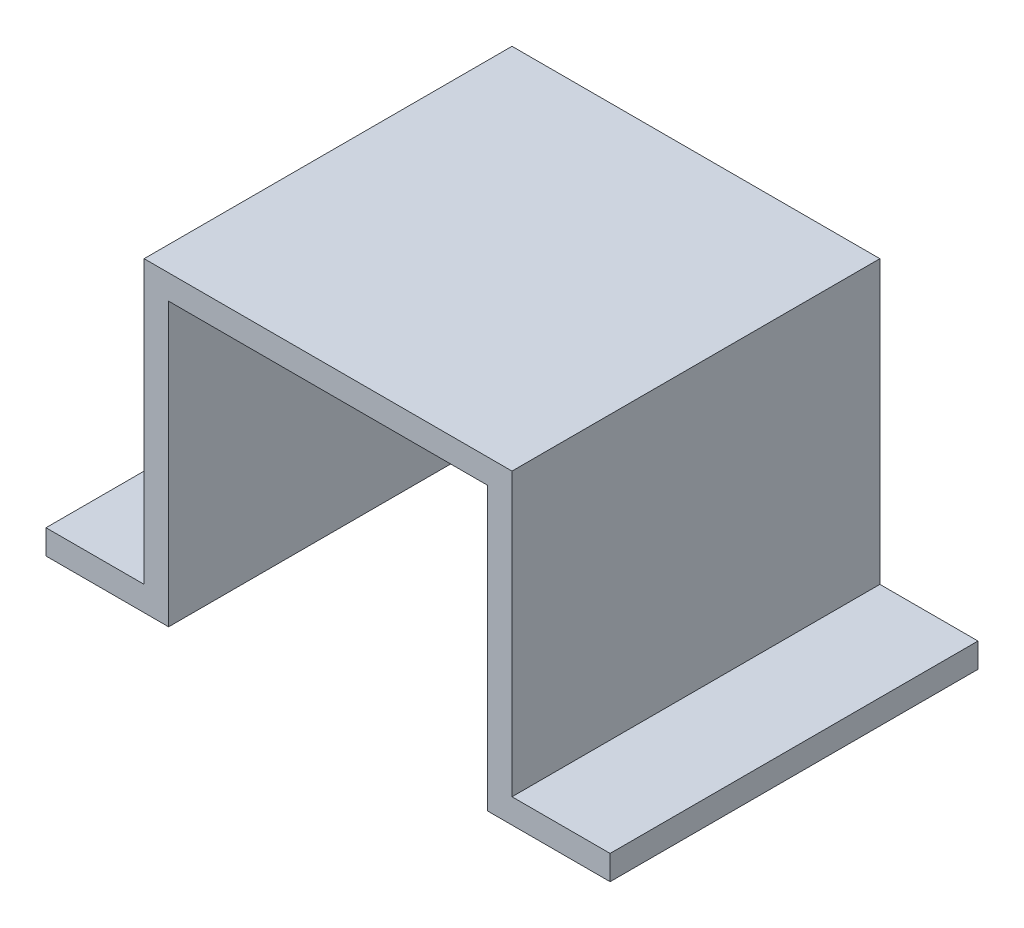
ISO-10303-21;
HEADER;
FILE_DESCRIPTION(('STEP AP214'),'2;1');
FILE_NAME('part.step','',(''),(''),'','','');
FILE_SCHEMA(('AUTOMOTIVE_DESIGN { 1 0 10303 214 1 1 1 1 }'));
ENDSEC;
DATA;
#1=APPLICATION_CONTEXT('core data for automotive mechanical design processes');
#2=APPLICATION_PROTOCOL_DEFINITION('international standard','automotive_design',2000,#1);
#3=PRODUCT_CONTEXT('',#1,'mechanical');
#4=PRODUCT('Part','Part','',(#3));
#5=PRODUCT_RELATED_PRODUCT_CATEGORY('part','',(#4));
#6=PRODUCT_DEFINITION_FORMATION('','',#4);
#7=PRODUCT_DEFINITION_CONTEXT('part definition',#1,'design');
#8=PRODUCT_DEFINITION('design','',#6,#7);
#9=PRODUCT_DEFINITION_SHAPE('','',#8);
#10=(LENGTH_UNIT() NAMED_UNIT(*) SI_UNIT(.MILLI.,.METRE.));
#11=(NAMED_UNIT(*) PLANE_ANGLE_UNIT() SI_UNIT($,.RADIAN.));
#12=(NAMED_UNIT(*) SI_UNIT($,.STERADIAN.) SOLID_ANGLE_UNIT());
#13=UNCERTAINTY_MEASURE_WITH_UNIT(LENGTH_MEASURE(1.E-05),#10,'distance_accuracy_value','');
#14=(GEOMETRIC_REPRESENTATION_CONTEXT(3) GLOBAL_UNCERTAINTY_ASSIGNED_CONTEXT((#13)) GLOBAL_UNIT_ASSIGNED_CONTEXT((#10,
#11,#12)) REPRESENTATION_CONTEXT('',''));
#15=CARTESIAN_POINT('',(0.,0.,0.));
#16=DIRECTION('',(0.,0.,1.));
#17=DIRECTION('',(1.,0.,0.));
#18=AXIS2_PLACEMENT_3D('',#15,#16,#17);
#19=CARTESIAN_POINT('',(0.,0.,-15.));
#20=DIRECTION('',(-1.,0.,0.));
#21=DIRECTION('',(0.,0.,1.));
#22=AXIS2_PLACEMENT_3D('',#19,#20,#21);
#23=PLANE('',#22);
#24=DIRECTION('',(0.,-1.,0.));
#25=VECTOR('',#24,1.);
#26=CARTESIAN_POINT('',(0.,0.,15.));
#27=LINE('',#26,#25);
#28=CARTESIAN_POINT('',(0.,2.,15.));
#29=VERTEX_POINT('',#28);
#30=CARTESIAN_POINT('',(0.,0.,15.));
#31=VERTEX_POINT('',#30);
#32=EDGE_CURVE('E156',#29,#31,#27,.T.);
#33=ORIENTED_EDGE('',*,*,#32,.F.);
#34=DIRECTION('',(0.,0.,1.));
#35=VECTOR('',#34,1.);
#36=CARTESIAN_POINT('',(0.,2.,-15.));
#37=LINE('',#36,#35);
#38=CARTESIAN_POINT('',(0.,2.,-15.));
#39=VERTEX_POINT('',#38);
#40=EDGE_CURVE('E11',#39,#29,#37,.T.);
#41=ORIENTED_EDGE('',*,*,#40,.F.);
#42=DIRECTION('',(0.,-1.,0.));
#43=VECTOR('',#42,1.);
#44=CARTESIAN_POINT('',(0.,0.,-15.));
#45=LINE('',#44,#43);
#46=CARTESIAN_POINT('',(0.,0.,-15.));
#47=VERTEX_POINT('',#46);
#48=EDGE_CURVE('E188',#39,#47,#45,.T.);
#49=ORIENTED_EDGE('',*,*,#48,.T.);
#50=DIRECTION('',(0.,0.,1.));
#51=VECTOR('',#50,1.);
#52=CARTESIAN_POINT('',(0.,0.,-15.));
#53=LINE('',#52,#51);
#54=EDGE_CURVE('E38',#47,#31,#53,.T.);
#55=ORIENTED_EDGE('',*,*,#54,.T.);
#56=EDGE_LOOP('',(#33,#41,#49,#55));
#57=FACE_BOUND('',#56,.T.);
#58=ADVANCED_FACE('F35',(#57),#23,.T.);
#59=CARTESIAN_POINT('',(0.,2.,-15.));
#60=DIRECTION('',(0.,1.,0.));
#61=DIRECTION('',(0.,0.,1.));
#62=AXIS2_PLACEMENT_3D('',#59,#60,#61);
#63=PLANE('',#62);
#64=DIRECTION('',(-1.,0.,0.));
#65=VECTOR('',#64,1.);
#66=CARTESIAN_POINT('',(0.,2.,15.));
#67=LINE('',#66,#65);
#68=CARTESIAN_POINT('',(8.,2.,15.));
#69=VERTEX_POINT('',#68);
#70=EDGE_CURVE('E186',#69,#29,#67,.T.);
#71=ORIENTED_EDGE('',*,*,#70,.F.);
#72=DIRECTION('',(0.,0.,1.));
#73=VECTOR('',#72,1.);
#74=CARTESIAN_POINT('',(8.,2.,-15.));
#75=LINE('',#74,#73);
#76=CARTESIAN_POINT('',(8.,2.,-15.));
#77=VERTEX_POINT('',#76);
#78=EDGE_CURVE('E44',#77,#69,#75,.T.);
#79=ORIENTED_EDGE('',*,*,#78,.F.);
#80=DIRECTION('',(-1.,0.,0.));
#81=VECTOR('',#80,1.);
#82=CARTESIAN_POINT('',(0.,2.,-15.));
#83=LINE('',#82,#81);
#84=EDGE_CURVE('E146',#77,#39,#83,.T.);
#85=ORIENTED_EDGE('',*,*,#84,.T.);
#86=ORIENTED_EDGE('',*,*,#40,.T.);
#87=EDGE_LOOP('',(#71,#79,#85,#86));
#88=FACE_BOUND('',#87,.T.);
#89=ADVANCED_FACE('F208',(#88),#63,.T.);
#90=CARTESIAN_POINT('',(8.,2.,-15.));
#91=DIRECTION('',(-1.,0.,0.));
#92=DIRECTION('',(0.,0.,1.));
#93=AXIS2_PLACEMENT_3D('',#90,#91,#92);
#94=PLANE('',#93);
#95=DIRECTION('',(0.,-1.,0.));
#96=VECTOR('',#95,1.);
#97=CARTESIAN_POINT('',(8.,2.,15.));
#98=LINE('',#97,#96);
#99=CARTESIAN_POINT('',(8.,25.,15.));
#100=VERTEX_POINT('',#99);
#101=EDGE_CURVE('E133',#100,#69,#98,.T.);
#102=ORIENTED_EDGE('',*,*,#101,.F.);
#103=DIRECTION('',(0.,0.,1.));
#104=VECTOR('',#103,1.);
#105=CARTESIAN_POINT('',(8.,25.,-15.));
#106=LINE('',#105,#104);
#107=CARTESIAN_POINT('',(8.,25.,-15.));
#108=VERTEX_POINT('',#107);
#109=EDGE_CURVE('E128',#108,#100,#106,.T.);
#110=ORIENTED_EDGE('',*,*,#109,.F.);
#111=DIRECTION('',(0.,-1.,0.));
#112=VECTOR('',#111,1.);
#113=CARTESIAN_POINT('',(8.,2.,-15.));
#114=LINE('',#113,#112);
#115=EDGE_CURVE('E131',#108,#77,#114,.T.);
#116=ORIENTED_EDGE('',*,*,#115,.T.);
#117=ORIENTED_EDGE('',*,*,#78,.T.);
#118=EDGE_LOOP('',(#102,#110,#116,#117));
#119=FACE_BOUND('',#118,.T.);
#120=ADVANCED_FACE('F130',(#119),#94,.T.);
#121=CARTESIAN_POINT('',(8.,25.,-15.));
#122=DIRECTION('',(0.,1.,0.));
#123=DIRECTION('',(0.,0.,1.));
#124=AXIS2_PLACEMENT_3D('',#121,#122,#123);
#125=PLANE('',#124);
#126=DIRECTION('',(-1.,0.,0.));
#127=VECTOR('',#126,1.);
#128=CARTESIAN_POINT('',(8.,25.,15.));
#129=LINE('',#128,#127);
#130=CARTESIAN_POINT('',(38.,25.,15.));
#131=VERTEX_POINT('',#130);
#132=EDGE_CURVE('E183',#131,#100,#129,.T.);
#133=ORIENTED_EDGE('',*,*,#132,.F.);
#134=DIRECTION('',(0.,0.,1.));
#135=VECTOR('',#134,1.);
#136=CARTESIAN_POINT('',(38.,25.,-15.));
#137=LINE('',#136,#135);
#138=CARTESIAN_POINT('',(38.,25.,-15.));
#139=VERTEX_POINT('',#138);
#140=EDGE_CURVE('E138',#139,#131,#137,.T.);
#141=ORIENTED_EDGE('',*,*,#140,.F.);
#142=DIRECTION('',(-1.,0.,0.));
#143=VECTOR('',#142,1.);
#144=CARTESIAN_POINT('',(8.,25.,-15.));
#145=LINE('',#144,#143);
#146=EDGE_CURVE('E144',#139,#108,#145,.T.);
#147=ORIENTED_EDGE('',*,*,#146,.T.);
#148=ORIENTED_EDGE('',*,*,#109,.T.);
#149=EDGE_LOOP('',(#133,#141,#147,#148));
#150=FACE_BOUND('',#149,.T.);
#151=ADVANCED_FACE('F148',(#150),#125,.T.);
#152=CARTESIAN_POINT('',(38.,2.,-15.));
#153=DIRECTION('',(1.,0.,0.));
#154=DIRECTION('',(0.,0.,-1.));
#155=AXIS2_PLACEMENT_3D('',#152,#153,#154);
#156=PLANE('',#155);
#157=DIRECTION('',(0.,1.,0.));
#158=VECTOR('',#157,1.);
#159=CARTESIAN_POINT('',(38.,2.,15.));
#160=LINE('',#159,#158);
#161=CARTESIAN_POINT('',(38.,2.,15.));
#162=VERTEX_POINT('',#161);
#163=EDGE_CURVE('E180',#162,#131,#160,.T.);
#164=ORIENTED_EDGE('',*,*,#163,.F.);
#165=DIRECTION('',(0.,0.,1.));
#166=VECTOR('',#165,1.);
#167=CARTESIAN_POINT('',(38.,2.,-15.));
#168=LINE('',#167,#166);
#169=CARTESIAN_POINT('',(38.,2.,-15.));
#170=VERTEX_POINT('',#169);
#171=EDGE_CURVE('E192',#170,#162,#168,.T.);
#172=ORIENTED_EDGE('',*,*,#171,.F.);
#173=DIRECTION('',(0.,1.,0.));
#174=VECTOR('',#173,1.);
#175=CARTESIAN_POINT('',(38.,2.,-15.));
#176=LINE('',#175,#174);
#177=EDGE_CURVE('E149',#170,#139,#176,.T.);
#178=ORIENTED_EDGE('',*,*,#177,.T.);
#179=ORIENTED_EDGE('',*,*,#140,.T.);
#180=EDGE_LOOP('',(#164,#172,#178,#179));
#181=FACE_BOUND('',#180,.T.);
#182=ADVANCED_FACE('F221',(#181),#156,.T.);
#183=CARTESIAN_POINT('',(46.,2.,-15.));
#184=DIRECTION('',(0.,1.,0.));
#185=DIRECTION('',(0.,0.,1.));
#186=AXIS2_PLACEMENT_3D('',#183,#184,#185);
#187=PLANE('',#186);
#188=DIRECTION('',(-1.,0.,0.));
#189=VECTOR('',#188,1.);
#190=CARTESIAN_POINT('',(46.,2.,15.));
#191=LINE('',#190,#189);
#192=CARTESIAN_POINT('',(46.,2.,15.));
#193=VERTEX_POINT('',#192);
#194=EDGE_CURVE('E177',#193,#162,#191,.T.);
#195=ORIENTED_EDGE('',*,*,#194,.F.);
#196=DIRECTION('',(0.,0.,1.));
#197=VECTOR('',#196,1.);
#198=CARTESIAN_POINT('',(46.,2.,-15.));
#199=LINE('',#198,#197);
#200=CARTESIAN_POINT('',(46.,2.,-15.));
#201=VERTEX_POINT('',#200);
#202=EDGE_CURVE('E194',#201,#193,#199,.T.);
#203=ORIENTED_EDGE('',*,*,#202,.F.);
#204=DIRECTION('',(-1.,0.,0.));
#205=VECTOR('',#204,1.);
#206=CARTESIAN_POINT('',(46.,2.,-15.));
#207=LINE('',#206,#205);
#208=EDGE_CURVE('E151',#201,#170,#207,.T.);
#209=ORIENTED_EDGE('',*,*,#208,.T.);
#210=ORIENTED_EDGE('',*,*,#171,.T.);
#211=EDGE_LOOP('',(#195,#203,#209,#210));
#212=FACE_BOUND('',#211,.T.);
#213=ADVANCED_FACE('F224',(#212),#187,.T.);
#214=CARTESIAN_POINT('',(46.,0.,-15.));
#215=DIRECTION('',(1.,0.,0.));
#216=DIRECTION('',(0.,0.,-1.));
#217=AXIS2_PLACEMENT_3D('',#214,#215,#216);
#218=PLANE('',#217);
#219=DIRECTION('',(0.,1.,0.));
#220=VECTOR('',#219,1.);
#221=CARTESIAN_POINT('',(46.,0.,15.));
#222=LINE('',#221,#220);
#223=CARTESIAN_POINT('',(46.,0.,15.));
#224=VERTEX_POINT('',#223);
#225=EDGE_CURVE('E174',#224,#193,#222,.T.);
#226=ORIENTED_EDGE('',*,*,#225,.F.);
#227=DIRECTION('',(0.,0.,1.));
#228=VECTOR('',#227,1.);
#229=CARTESIAN_POINT('',(46.,0.,-15.));
#230=LINE('',#229,#228);
#231=CARTESIAN_POINT('',(46.,0.,-15.));
#232=VERTEX_POINT('',#231);
#233=EDGE_CURVE('E196',#232,#224,#230,.T.);
#234=ORIENTED_EDGE('',*,*,#233,.F.);
#235=DIRECTION('',(0.,1.,0.));
#236=VECTOR('',#235,1.);
#237=CARTESIAN_POINT('',(46.,0.,-15.));
#238=LINE('',#237,#236);
#239=EDGE_CURVE('E350',#232,#201,#238,.T.);
#240=ORIENTED_EDGE('',*,*,#239,.T.);
#241=ORIENTED_EDGE('',*,*,#202,.T.);
#242=EDGE_LOOP('',(#226,#234,#240,#241));
#243=FACE_BOUND('',#242,.T.);
#244=ADVANCED_FACE('F228',(#243),#218,.T.);
#245=CARTESIAN_POINT('',(46.,0.,-15.));
#246=DIRECTION('',(0.,-1.,0.));
#247=DIRECTION('',(0.,0.,-1.));
#248=AXIS2_PLACEMENT_3D('',#245,#246,#247);
#249=PLANE('',#248);
#250=DIRECTION('',(1.,0.,0.));
#251=VECTOR('',#250,1.);
#252=CARTESIAN_POINT('',(46.,0.,15.));
#253=LINE('',#252,#251);
#254=CARTESIAN_POINT('',(36.,0.,15.));
#255=VERTEX_POINT('',#254);
#256=EDGE_CURVE('E171',#255,#224,#253,.T.);
#257=ORIENTED_EDGE('',*,*,#256,.F.);
#258=DIRECTION('',(0.,0.,1.));
#259=VECTOR('',#258,1.);
#260=CARTESIAN_POINT('',(36.,0.,-15.));
#261=LINE('',#260,#259);
#262=CARTESIAN_POINT('',(36.,0.,-15.));
#263=VERTEX_POINT('',#262);
#264=EDGE_CURVE('E198',#263,#255,#261,.T.);
#265=ORIENTED_EDGE('',*,*,#264,.F.);
#266=DIRECTION('',(1.,0.,0.));
#267=VECTOR('',#266,1.);
#268=CARTESIAN_POINT('',(46.,0.,-15.));
#269=LINE('',#268,#267);
#270=EDGE_CURVE('E354',#263,#232,#269,.T.);
#271=ORIENTED_EDGE('',*,*,#270,.T.);
#272=ORIENTED_EDGE('',*,*,#233,.T.);
#273=EDGE_LOOP('',(#257,#265,#271,#272));
#274=FACE_BOUND('',#273,.T.);
#275=ADVANCED_FACE('F232',(#274),#249,.T.);
#276=CARTESIAN_POINT('',(36.,0.,-15.));
#277=DIRECTION('',(-1.,0.,0.));
#278=DIRECTION('',(0.,0.,1.));
#279=AXIS2_PLACEMENT_3D('',#276,#277,#278);
#280=PLANE('',#279);
#281=DIRECTION('',(0.,-1.,0.));
#282=VECTOR('',#281,1.);
#283=CARTESIAN_POINT('',(36.,0.,15.));
#284=LINE('',#283,#282);
#285=CARTESIAN_POINT('',(36.,23.,15.));
#286=VERTEX_POINT('',#285);
#287=EDGE_CURVE('E168',#286,#255,#284,.T.);
#288=ORIENTED_EDGE('',*,*,#287,.F.);
#289=DIRECTION('',(0.,0.,1.));
#290=VECTOR('',#289,1.);
#291=CARTESIAN_POINT('',(36.,23.,-15.));
#292=LINE('',#291,#290);
#293=CARTESIAN_POINT('',(36.,23.,-15.));
#294=VERTEX_POINT('',#293);
#295=EDGE_CURVE('E200',#294,#286,#292,.T.);
#296=ORIENTED_EDGE('',*,*,#295,.F.);
#297=DIRECTION('',(0.,-1.,0.));
#298=VECTOR('',#297,1.);
#299=CARTESIAN_POINT('',(36.,0.,-15.));
#300=LINE('',#299,#298);
#301=EDGE_CURVE('E343',#294,#263,#300,.T.);
#302=ORIENTED_EDGE('',*,*,#301,.T.);
#303=ORIENTED_EDGE('',*,*,#264,.T.);
#304=EDGE_LOOP('',(#288,#296,#302,#303));
#305=FACE_BOUND('',#304,.T.);
#306=ADVANCED_FACE('F236',(#305),#280,.T.);
#307=CARTESIAN_POINT('',(10.,23.,-15.));
#308=DIRECTION('',(0.,-1.,0.));
#309=DIRECTION('',(0.,0.,-1.));
#310=AXIS2_PLACEMENT_3D('',#307,#308,#309);
#311=PLANE('',#310);
#312=DIRECTION('',(1.,0.,0.));
#313=VECTOR('',#312,1.);
#314=CARTESIAN_POINT('',(10.,23.,15.));
#315=LINE('',#314,#313);
#316=CARTESIAN_POINT('',(10.,23.,15.));
#317=VERTEX_POINT('',#316);
#318=EDGE_CURVE('E165',#317,#286,#315,.T.);
#319=ORIENTED_EDGE('',*,*,#318,.F.);
#320=DIRECTION('',(0.,0.,1.));
#321=VECTOR('',#320,1.);
#322=CARTESIAN_POINT('',(10.,23.,-15.));
#323=LINE('',#322,#321);
#324=CARTESIAN_POINT('',(10.,23.,-15.));
#325=VERTEX_POINT('',#324);
#326=EDGE_CURVE('E202',#325,#317,#323,.T.);
#327=ORIENTED_EDGE('',*,*,#326,.F.);
#328=DIRECTION('',(1.,0.,0.));
#329=VECTOR('',#328,1.);
#330=CARTESIAN_POINT('',(10.,23.,-15.));
#331=LINE('',#330,#329);
#332=EDGE_CURVE('E339',#325,#294,#331,.T.);
#333=ORIENTED_EDGE('',*,*,#332,.T.);
#334=ORIENTED_EDGE('',*,*,#295,.T.);
#335=EDGE_LOOP('',(#319,#327,#333,#334));
#336=FACE_BOUND('',#335,.T.);
#337=ADVANCED_FACE('F240',(#336),#311,.T.);
#338=CARTESIAN_POINT('',(10.,0.,-15.));
#339=DIRECTION('',(1.,0.,0.));
#340=DIRECTION('',(0.,1.,0.));
#341=AXIS2_PLACEMENT_3D('',#338,#339,#340);
#342=PLANE('',#341);
#343=DIRECTION('',(0.,1.,0.));
#344=VECTOR('',#343,1.);
#345=CARTESIAN_POINT('',(10.,0.,15.));
#346=LINE('',#345,#344);
#347=CARTESIAN_POINT('',(10.,0.,15.));
#348=VERTEX_POINT('',#347);
#349=EDGE_CURVE('E162',#348,#317,#346,.T.);
#350=ORIENTED_EDGE('',*,*,#349,.F.);
#351=DIRECTION('',(0.,0.,1.));
#352=VECTOR('',#351,1.);
#353=CARTESIAN_POINT('',(10.,0.,-15.));
#354=LINE('',#353,#352);
#355=CARTESIAN_POINT('',(10.,0.,-15.));
#356=VERTEX_POINT('',#355);
#357=EDGE_CURVE('E203',#356,#348,#354,.T.);
#358=ORIENTED_EDGE('',*,*,#357,.F.);
#359=DIRECTION('',(0.,1.,0.));
#360=VECTOR('',#359,1.);
#361=CARTESIAN_POINT('',(10.,0.,-15.));
#362=LINE('',#361,#360);
#363=EDGE_CURVE('E360',#356,#325,#362,.T.);
#364=ORIENTED_EDGE('',*,*,#363,.T.);
#365=ORIENTED_EDGE('',*,*,#326,.T.);
#366=EDGE_LOOP('',(#350,#358,#364,#365));
#367=FACE_BOUND('',#366,.T.);
#368=ADVANCED_FACE('F244',(#367),#342,.T.);
#369=CARTESIAN_POINT('',(0.,0.,-15.));
#370=DIRECTION('',(0.,-1.,0.));
#371=DIRECTION('',(0.,0.,-1.));
#372=AXIS2_PLACEMENT_3D('',#369,#370,#371);
#373=PLANE('',#372);
#374=DIRECTION('',(1.,0.,0.));
#375=VECTOR('',#374,1.);
#376=CARTESIAN_POINT('',(0.,0.,15.));
#377=LINE('',#376,#375);
#378=EDGE_CURVE('E159',#31,#348,#377,.T.);
#379=ORIENTED_EDGE('',*,*,#378,.F.);
#380=ORIENTED_EDGE('',*,*,#54,.F.);
#381=DIRECTION('',(1.,0.,0.));
#382=VECTOR('',#381,1.);
#383=CARTESIAN_POINT('',(0.,0.,-15.));
#384=LINE('',#383,#382);
#385=EDGE_CURVE('E362',#47,#356,#384,.T.);
#386=ORIENTED_EDGE('',*,*,#385,.T.);
#387=ORIENTED_EDGE('',*,*,#357,.T.);
#388=EDGE_LOOP('',(#379,#380,#386,#387));
#389=FACE_BOUND('',#388,.T.);
#390=ADVANCED_FACE('F205',(#389),#373,.T.);
#391=CARTESIAN_POINT('',(0.,0.,-15.));
#392=DIRECTION('',(0.,0.,-1.));
#393=DIRECTION('',(-1.,0.,0.));
#394=AXIS2_PLACEMENT_3D('',#391,#392,#393);
#395=PLANE('',#394);
#396=ORIENTED_EDGE('',*,*,#48,.F.);
#397=ORIENTED_EDGE('',*,*,#84,.F.);
#398=ORIENTED_EDGE('',*,*,#115,.F.);
#399=ORIENTED_EDGE('',*,*,#146,.F.);
#400=ORIENTED_EDGE('',*,*,#177,.F.);
#401=ORIENTED_EDGE('',*,*,#208,.F.);
#402=ORIENTED_EDGE('',*,*,#239,.F.);
#403=ORIENTED_EDGE('',*,*,#270,.F.);
#404=ORIENTED_EDGE('',*,*,#301,.F.);
#405=ORIENTED_EDGE('',*,*,#332,.F.);
#406=ORIENTED_EDGE('',*,*,#363,.F.);
#407=ORIENTED_EDGE('',*,*,#385,.F.);
#408=EDGE_LOOP('',(#396,#397,#398,#399,#400,#401,#402,#403,#404,#405,#406,#407));
#409=FACE_BOUND('',#408,.T.);
#410=ADVANCED_FACE('F142',(#409),#395,.T.);
#411=CARTESIAN_POINT('',(0.,0.,15.));
#412=DIRECTION('',(0.,0.,-1.));
#413=DIRECTION('',(-1.,0.,0.));
#414=AXIS2_PLACEMENT_3D('',#411,#412,#413);
#415=PLANE('',#414);
#416=ORIENTED_EDGE('',*,*,#32,.T.);
#417=ORIENTED_EDGE('',*,*,#378,.T.);
#418=ORIENTED_EDGE('',*,*,#349,.T.);
#419=ORIENTED_EDGE('',*,*,#318,.T.);
#420=ORIENTED_EDGE('',*,*,#287,.T.);
#421=ORIENTED_EDGE('',*,*,#256,.T.);
#422=ORIENTED_EDGE('',*,*,#225,.T.);
#423=ORIENTED_EDGE('',*,*,#194,.T.);
#424=ORIENTED_EDGE('',*,*,#163,.T.);
#425=ORIENTED_EDGE('',*,*,#132,.T.);
#426=ORIENTED_EDGE('',*,*,#101,.T.);
#427=ORIENTED_EDGE('',*,*,#70,.T.);
#428=EDGE_LOOP('',(#416,#417,#418,#419,#420,#421,#422,#423,#424,#425,#426,#427));
#429=FACE_BOUND('',#428,.T.);
#430=ADVANCED_FACE('F207',(#429),#415,.F.);
#431=CLOSED_SHELL('',(#58,#89,#120,#151,#182,#213,#244,#275,#306,#337,#368,#390,#410,#430));
#432=MANIFOLD_SOLID_BREP('B2',#431);
#433=ADVANCED_BREP_SHAPE_REPRESENTATION('',(#18,#432),#14);
#434=SHAPE_DEFINITION_REPRESENTATION(#9,#433);
ENDSEC;
END-ISO-10303-21;
